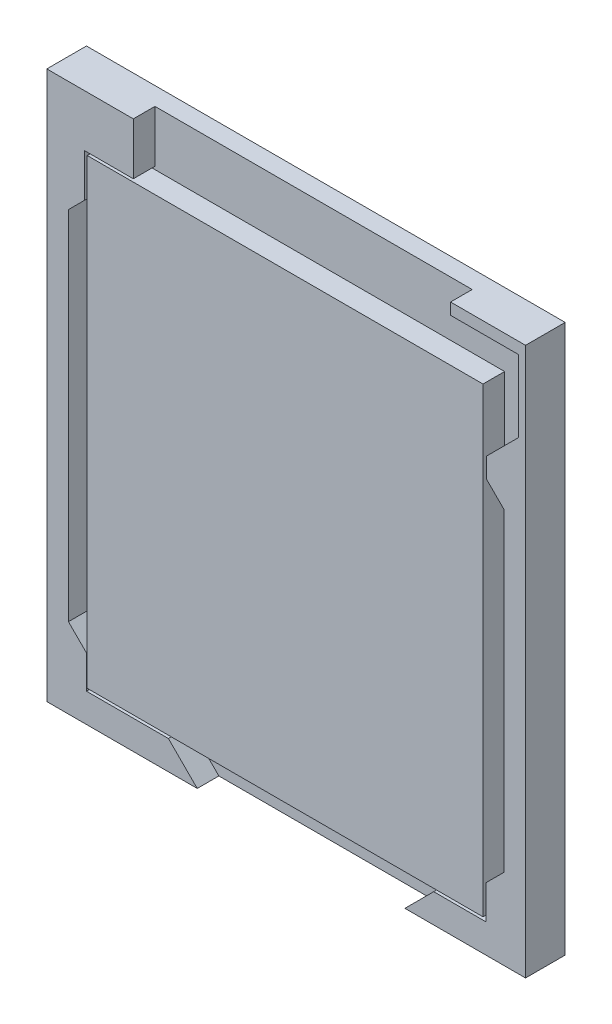
ISO-10303-21;
HEADER;
FILE_DESCRIPTION(('STEP AP214'),'2;1');
FILE_NAME('part.step','',(''),(''),'','','');
FILE_SCHEMA(('AUTOMOTIVE_DESIGN { 1 0 10303 214 1 1 1 1 }'));
ENDSEC;
DATA;
#1=APPLICATION_CONTEXT('core data for automotive mechanical design processes');
#2=APPLICATION_PROTOCOL_DEFINITION('international standard','automotive_design',2000,#1);
#3=PRODUCT_CONTEXT('',#1,'mechanical');
#4=PRODUCT('Part','Part','',(#3));
#5=PRODUCT_RELATED_PRODUCT_CATEGORY('part','',(#4));
#6=PRODUCT_DEFINITION_FORMATION('','',#4);
#7=PRODUCT_DEFINITION_CONTEXT('part definition',#1,'design');
#8=PRODUCT_DEFINITION('design','',#6,#7);
#9=PRODUCT_DEFINITION_SHAPE('','',#8);
#10=(LENGTH_UNIT() NAMED_UNIT(*) SI_UNIT(.MILLI.,.METRE.));
#11=(NAMED_UNIT(*) PLANE_ANGLE_UNIT() SI_UNIT($,.RADIAN.));
#12=(NAMED_UNIT(*) SI_UNIT($,.STERADIAN.) SOLID_ANGLE_UNIT());
#13=UNCERTAINTY_MEASURE_WITH_UNIT(LENGTH_MEASURE(1.E-05),#10,'distance_accuracy_value','');
#14=(GEOMETRIC_REPRESENTATION_CONTEXT(3) GLOBAL_UNCERTAINTY_ASSIGNED_CONTEXT((#13)) GLOBAL_UNIT_ASSIGNED_CONTEXT((#10,
#11,#12)) REPRESENTATION_CONTEXT('',''));
#15=CARTESIAN_POINT('',(0.,0.,0.));
#16=DIRECTION('',(0.,0.,1.));
#17=DIRECTION('',(1.,0.,0.));
#18=AXIS2_PLACEMENT_3D('',#15,#16,#17);
#19=CARTESIAN_POINT('',(0.,0.,1.25));
#20=DIRECTION('',(0.,0.,1.));
#21=DIRECTION('',(1.,0.,0.));
#22=AXIS2_PLACEMENT_3D('',#19,#20,#21);
#23=PLANE('',#22);
#24=DIRECTION('',(0.707106781186546,-0.707106781186549,0.));
#25=VECTOR('',#24,1.);
#26=CARTESIAN_POINT('',(-8.16774694977854,-17.,1.25));
#27=LINE('',#26,#25);
#28=CARTESIAN_POINT('',(-8.16774694977854,-17.,1.25));
#29=VERTEX_POINT('',#28);
#30=CARTESIAN_POINT('',(-6.16774694977855,-19.,1.25));
#31=VERTEX_POINT('',#30);
#32=EDGE_CURVE('E263',#29,#31,#27,.T.);
#33=ORIENTED_EDGE('',*,*,#32,.T.);
#34=DIRECTION('',(1.,0.,0.));
#35=VECTOR('',#34,1.);
#36=CARTESIAN_POINT('',(-6.16774694977855,-19.,1.25));
#37=LINE('',#36,#35);
#38=CARTESIAN_POINT('',(8.23225305022145,-19.,1.25));
#39=VERTEX_POINT('',#38);
#40=EDGE_CURVE('E266',#31,#39,#37,.T.);
#41=ORIENTED_EDGE('',*,*,#40,.T.);
#42=DIRECTION('',(0.70710678118655,0.707106781186545,0.));
#43=VECTOR('',#42,1.);
#44=CARTESIAN_POINT('',(8.23225305022145,-19.,1.25));
#45=LINE('',#44,#43);
#46=CARTESIAN_POINT('',(10.2322530502215,-17.,1.25));
#47=VERTEX_POINT('',#46);
#48=EDGE_CURVE('E270',#39,#47,#45,.T.);
#49=ORIENTED_EDGE('',*,*,#48,.T.);
#50=DIRECTION('',(1.,0.,0.));
#51=VECTOR('',#50,1.);
#52=CARTESIAN_POINT('',(10.2322530502215,-17.,1.25));
#53=LINE('',#52,#51);
#54=CARTESIAN_POINT('',(13.85,-17.,1.25));
#55=VERTEX_POINT('',#54);
#56=EDGE_CURVE('E273',#47,#55,#53,.T.);
#57=ORIENTED_EDGE('',*,*,#56,.T.);
#58=DIRECTION('',(0.,1.,0.));
#59=VECTOR('',#58,1.);
#60=CARTESIAN_POINT('',(13.85,-17.,1.25));
#61=LINE('',#60,#59);
#62=CARTESIAN_POINT('',(13.85,-14.6554244337926,1.25));
#63=VERTEX_POINT('',#62);
#64=EDGE_CURVE('E276',#55,#63,#61,.T.);
#65=ORIENTED_EDGE('',*,*,#64,.T.);
#66=DIRECTION('',(0.707106781186549,0.707106781186546,0.));
#67=VECTOR('',#66,1.);
#68=CARTESIAN_POINT('',(13.85,-14.6554244337926,1.25));
#69=LINE('',#68,#67);
#70=CARTESIAN_POINT('',(15.1,-13.4054244337926,1.25));
#71=VERTEX_POINT('',#70);
#72=EDGE_CURVE('E279',#63,#71,#69,.T.);
#73=ORIENTED_EDGE('',*,*,#72,.T.);
#74=DIRECTION('',(0.,1.,0.));
#75=VECTOR('',#74,1.);
#76=CARTESIAN_POINT('',(15.1,-13.4054244337926,1.25));
#77=LINE('',#76,#75);
#78=CARTESIAN_POINT('',(15.1,8.4,1.25));
#79=VERTEX_POINT('',#78);
#80=EDGE_CURVE('E282',#71,#79,#77,.T.);
#81=ORIENTED_EDGE('',*,*,#80,.T.);
#82=DIRECTION('',(-0.707106781186547,0.707106781186548,0.));
#83=VECTOR('',#82,1.);
#84=CARTESIAN_POINT('',(15.1,8.4,1.25));
#85=LINE('',#84,#83);
#86=CARTESIAN_POINT('',(13.9,9.6,1.25));
#87=VERTEX_POINT('',#86);
#88=EDGE_CURVE('E285',#79,#87,#85,.T.);
#89=ORIENTED_EDGE('',*,*,#88,.T.);
#90=DIRECTION('',(0.,1.,0.));
#91=VECTOR('',#90,1.);
#92=CARTESIAN_POINT('',(13.9,9.6,1.25));
#93=LINE('',#92,#91);
#94=CARTESIAN_POINT('',(13.9,11.,1.25));
#95=VERTEX_POINT('',#94);
#96=EDGE_CURVE('E288',#87,#95,#93,.T.);
#97=ORIENTED_EDGE('',*,*,#96,.T.);
#98=DIRECTION('',(0.707106781186547,0.707106781186548,0.));
#99=VECTOR('',#98,1.);
#100=CARTESIAN_POINT('',(13.9,11.,1.25));
#101=LINE('',#100,#99);
#102=CARTESIAN_POINT('',(16.1,13.2,1.25));
#103=VERTEX_POINT('',#102);
#104=EDGE_CURVE('E291',#95,#103,#101,.T.);
#105=ORIENTED_EDGE('',*,*,#104,.T.);
#106=DIRECTION('',(0.,1.,0.));
#107=VECTOR('',#106,1.);
#108=CARTESIAN_POINT('',(16.1,13.2,1.25));
#109=LINE('',#108,#107);
#110=CARTESIAN_POINT('',(16.1,18.2,1.25));
#111=VERTEX_POINT('',#110);
#112=EDGE_CURVE('E294',#103,#111,#109,.T.);
#113=ORIENTED_EDGE('',*,*,#112,.T.);
#114=DIRECTION('',(-1.,0.,0.));
#115=VECTOR('',#114,1.);
#116=CARTESIAN_POINT('',(16.1,18.2,1.25));
#117=LINE('',#116,#115);
#118=CARTESIAN_POINT('',(11.4,18.2,1.25));
#119=VERTEX_POINT('',#118);
#120=EDGE_CURVE('E297',#111,#119,#117,.T.);
#121=ORIENTED_EDGE('',*,*,#120,.T.);
#122=DIRECTION('',(0.,1.,0.));
#123=VECTOR('',#122,1.);
#124=CARTESIAN_POINT('',(11.4,18.2,1.25));
#125=LINE('',#124,#123);
#126=CARTESIAN_POINT('',(11.4,19.,1.25));
#127=VERTEX_POINT('',#126);
#128=EDGE_CURVE('E300',#119,#127,#125,.T.);
#129=ORIENTED_EDGE('',*,*,#128,.T.);
#130=DIRECTION('',(-1.,0.,0.));
#131=VECTOR('',#130,1.);
#132=CARTESIAN_POINT('',(11.4,19.,1.25));
#133=LINE('',#132,#131);
#134=CARTESIAN_POINT('',(-10.6,19.,1.25));
#135=VERTEX_POINT('',#134);
#136=EDGE_CURVE('E303',#127,#135,#133,.T.);
#137=ORIENTED_EDGE('',*,*,#136,.T.);
#138=DIRECTION('',(0.,-1.,0.));
#139=VECTOR('',#138,1.);
#140=CARTESIAN_POINT('',(-10.6,19.,1.25));
#141=LINE('',#140,#139);
#142=CARTESIAN_POINT('',(-10.6,15.4,1.25));
#143=VERTEX_POINT('',#142);
#144=EDGE_CURVE('E306',#135,#143,#141,.T.);
#145=ORIENTED_EDGE('',*,*,#144,.T.);
#146=DIRECTION('',(-1.,0.,0.));
#147=VECTOR('',#146,1.);
#148=CARTESIAN_POINT('',(-10.6,15.4,1.25));
#149=LINE('',#148,#147);
#150=CARTESIAN_POINT('',(-14.,15.4,1.25));
#151=VERTEX_POINT('',#150);
#152=EDGE_CURVE('E309',#143,#151,#149,.T.);
#153=ORIENTED_EDGE('',*,*,#152,.T.);
#154=DIRECTION('',(0.,-1.,0.));
#155=VECTOR('',#154,1.);
#156=CARTESIAN_POINT('',(-14.,15.4,1.25));
#157=LINE('',#156,#155);
#158=CARTESIAN_POINT('',(-14.,12.4,1.25));
#159=VERTEX_POINT('',#158);
#160=EDGE_CURVE('E312',#151,#159,#157,.T.);
#161=ORIENTED_EDGE('',*,*,#160,.T.);
#162=DIRECTION('',(-0.707106781186547,-0.707106781186548,0.));
#163=VECTOR('',#162,1.);
#164=CARTESIAN_POINT('',(-14.,12.4,1.25));
#165=LINE('',#164,#163);
#166=CARTESIAN_POINT('',(-15.1,11.3,1.25));
#167=VERTEX_POINT('',#166);
#168=EDGE_CURVE('E315',#159,#167,#165,.T.);
#169=ORIENTED_EDGE('',*,*,#168,.T.);
#170=DIRECTION('',(0.,-1.,0.));
#171=VECTOR('',#170,1.);
#172=CARTESIAN_POINT('',(-15.1,11.3,1.25));
#173=LINE('',#172,#171);
#174=CARTESIAN_POINT('',(-15.1,-13.45,1.25));
#175=VERTEX_POINT('',#174);
#176=EDGE_CURVE('E318',#167,#175,#173,.T.);
#177=ORIENTED_EDGE('',*,*,#176,.T.);
#178=DIRECTION('',(0.70710678118655,-0.707106781186545,0.));
#179=VECTOR('',#178,1.);
#180=CARTESIAN_POINT('',(-15.1,-13.45,1.25));
#181=LINE('',#180,#179);
#182=CARTESIAN_POINT('',(-13.85,-14.7,1.25));
#183=VERTEX_POINT('',#182);
#184=EDGE_CURVE('E321',#175,#183,#181,.T.);
#185=ORIENTED_EDGE('',*,*,#184,.T.);
#186=DIRECTION('',(0.,-1.,0.));
#187=VECTOR('',#186,1.);
#188=CARTESIAN_POINT('',(-13.85,-14.7,1.25));
#189=LINE('',#188,#187);
#190=CARTESIAN_POINT('',(-13.85,-17.,1.25));
#191=VERTEX_POINT('',#190);
#192=EDGE_CURVE('E324',#183,#191,#189,.T.);
#193=ORIENTED_EDGE('',*,*,#192,.T.);
#194=DIRECTION('',(1.,0.,0.));
#195=VECTOR('',#194,1.);
#196=CARTESIAN_POINT('',(-13.85,-17.,1.25));
#197=LINE('',#196,#195);
#198=EDGE_CURVE('E327',#191,#29,#197,.T.);
#199=ORIENTED_EDGE('',*,*,#198,.T.);
#200=EDGE_LOOP('',(#33,#41,#49,#57,#65,#73,#81,#89,#97,#105,#113,#121,#129,#137,#145,#153,#161,
#169,#177,#185,#193,#199));
#201=FACE_BOUND('',#200,.T.);
#202=DIRECTION('',(1.,0.,0.));
#203=VECTOR('',#202,1.);
#204=CARTESIAN_POINT('',(-13.8,-16.8,1.25));
#205=LINE('',#204,#203);
#206=CARTESIAN_POINT('',(-13.8,-16.8,1.25));
#207=VERTEX_POINT('',#206);
#208=CARTESIAN_POINT('',(13.65,-16.8,1.25));
#209=VERTEX_POINT('',#208);
#210=EDGE_CURVE('E669',#207,#209,#205,.T.);
#211=ORIENTED_EDGE('',*,*,#210,.F.);
#212=DIRECTION('',(0.,-1.,0.));
#213=VECTOR('',#212,1.);
#214=CARTESIAN_POINT('',(-13.8,15.2,1.25));
#215=LINE('',#214,#213);
#216=CARTESIAN_POINT('',(-13.8,15.2,1.25));
#217=VERTEX_POINT('',#216);
#218=EDGE_CURVE('E254',#217,#207,#215,.T.);
#219=ORIENTED_EDGE('',*,*,#218,.F.);
#220=DIRECTION('',(-1.,0.,0.));
#221=VECTOR('',#220,1.);
#222=CARTESIAN_POINT('',(-13.8,15.2,1.25));
#223=LINE('',#222,#221);
#224=CARTESIAN_POINT('',(13.65,15.2,1.25));
#225=VERTEX_POINT('',#224);
#226=EDGE_CURVE('E250',#225,#217,#223,.T.);
#227=ORIENTED_EDGE('',*,*,#226,.F.);
#228=DIRECTION('',(0.,1.,0.));
#229=VECTOR('',#228,1.);
#230=CARTESIAN_POINT('',(13.65,15.2,1.25));
#231=LINE('',#230,#229);
#232=EDGE_CURVE('E666',#209,#225,#231,.T.);
#233=ORIENTED_EDGE('',*,*,#232,.F.);
#234=EDGE_LOOP('',(#211,#219,#227,#233));
#235=FACE_BOUND('',#234,.T.);
#236=ADVANCED_FACE('F33',(#201,#235),#23,.T.);
#237=CARTESIAN_POINT('',(0.,0.,2.75));
#238=DIRECTION('',(0.,0.,-1.));
#239=DIRECTION('',(-1.,0.,0.));
#240=AXIS2_PLACEMENT_3D('',#237,#238,#239);
#241=PLANE('',#240);
#242=DIRECTION('',(1.,0.,0.));
#243=VECTOR('',#242,1.);
#244=CARTESIAN_POINT('',(-16.6,-19.,2.75));
#245=LINE('',#244,#243);
#246=CARTESIAN_POINT('',(-16.6,-19.,2.75));
#247=VERTEX_POINT('',#246);
#248=CARTESIAN_POINT('',(-6.16774694977855,-19.,2.75));
#249=VERTEX_POINT('',#248);
#250=EDGE_CURVE('E440',#247,#249,#245,.T.);
#251=ORIENTED_EDGE('',*,*,#250,.T.);
#252=DIRECTION('',(0.707106781186546,-0.707106781186549,0.));
#253=VECTOR('',#252,1.);
#254=CARTESIAN_POINT('',(-8.16774694977854,-17.,2.75));
#255=LINE('',#254,#253);
#256=CARTESIAN_POINT('',(-8.16774694977854,-17.,2.75));
#257=VERTEX_POINT('',#256);
#258=EDGE_CURVE('E256',#257,#249,#255,.T.);
#259=ORIENTED_EDGE('',*,*,#258,.F.);
#260=DIRECTION('',(1.,0.,0.));
#261=VECTOR('',#260,1.);
#262=CARTESIAN_POINT('',(-13.85,-17.,2.75));
#263=LINE('',#262,#261);
#264=CARTESIAN_POINT('',(-13.85,-17.,2.75));
#265=VERTEX_POINT('',#264);
#266=EDGE_CURVE('E267',#265,#257,#263,.T.);
#267=ORIENTED_EDGE('',*,*,#266,.F.);
#268=DIRECTION('',(0.,-1.,0.));
#269=VECTOR('',#268,1.);
#270=CARTESIAN_POINT('',(-13.85,-14.7,2.75));
#271=LINE('',#270,#269);
#272=CARTESIAN_POINT('',(-13.85,-14.7,2.75));
#273=VERTEX_POINT('',#272);
#274=EDGE_CURVE('E379',#273,#265,#271,.T.);
#275=ORIENTED_EDGE('',*,*,#274,.F.);
#276=DIRECTION('',(0.70710678118655,-0.707106781186545,0.));
#277=VECTOR('',#276,1.);
#278=CARTESIAN_POINT('',(-15.1,-13.45,2.75));
#279=LINE('',#278,#277);
#280=CARTESIAN_POINT('',(-15.1,-13.45,2.75));
#281=VERTEX_POINT('',#280);
#282=EDGE_CURVE('E376',#281,#273,#279,.T.);
#283=ORIENTED_EDGE('',*,*,#282,.F.);
#284=DIRECTION('',(0.,-1.,0.));
#285=VECTOR('',#284,1.);
#286=CARTESIAN_POINT('',(-15.1,11.3,2.75));
#287=LINE('',#286,#285);
#288=CARTESIAN_POINT('',(-15.1,11.3,2.75));
#289=VERTEX_POINT('',#288);
#290=EDGE_CURVE('E373',#289,#281,#287,.T.);
#291=ORIENTED_EDGE('',*,*,#290,.F.);
#292=DIRECTION('',(-0.707106781186547,-0.707106781186548,0.));
#293=VECTOR('',#292,1.);
#294=CARTESIAN_POINT('',(-14.,12.4,2.75));
#295=LINE('',#294,#293);
#296=CARTESIAN_POINT('',(-14.,12.4,2.75));
#297=VERTEX_POINT('',#296);
#298=EDGE_CURVE('E370',#297,#289,#295,.T.);
#299=ORIENTED_EDGE('',*,*,#298,.F.);
#300=DIRECTION('',(0.,-1.,0.));
#301=VECTOR('',#300,1.);
#302=CARTESIAN_POINT('',(-14.,15.4,2.75));
#303=LINE('',#302,#301);
#304=CARTESIAN_POINT('',(-14.,15.4,2.75));
#305=VERTEX_POINT('',#304);
#306=EDGE_CURVE('E367',#305,#297,#303,.T.);
#307=ORIENTED_EDGE('',*,*,#306,.F.);
#308=DIRECTION('',(-1.,0.,0.));
#309=VECTOR('',#308,1.);
#310=CARTESIAN_POINT('',(-10.6,15.4,2.75));
#311=LINE('',#310,#309);
#312=CARTESIAN_POINT('',(-10.6,15.4,2.75));
#313=VERTEX_POINT('',#312);
#314=EDGE_CURVE('E364',#313,#305,#311,.T.);
#315=ORIENTED_EDGE('',*,*,#314,.F.);
#316=DIRECTION('',(0.,-1.,0.));
#317=VECTOR('',#316,1.);
#318=CARTESIAN_POINT('',(-10.6,19.,2.75));
#319=LINE('',#318,#317);
#320=CARTESIAN_POINT('',(-10.6,19.,2.75));
#321=VERTEX_POINT('',#320);
#322=EDGE_CURVE('E361',#321,#313,#319,.T.);
#323=ORIENTED_EDGE('',*,*,#322,.F.);
#324=DIRECTION('',(-1.,0.,0.));
#325=VECTOR('',#324,1.);
#326=CARTESIAN_POINT('',(-16.6,19.,2.75));
#327=LINE('',#326,#325);
#328=CARTESIAN_POINT('',(-16.6,19.,2.75));
#329=VERTEX_POINT('',#328);
#330=EDGE_CURVE('E432',#321,#329,#327,.T.);
#331=ORIENTED_EDGE('',*,*,#330,.T.);
#332=DIRECTION('',(0.,-1.,0.));
#333=VECTOR('',#332,1.);
#334=CARTESIAN_POINT('',(-16.6,-19.,2.75));
#335=LINE('',#334,#333);
#336=EDGE_CURVE('E437',#329,#247,#335,.T.);
#337=ORIENTED_EDGE('',*,*,#336,.T.);
#338=EDGE_LOOP('',(#251,#259,#267,#275,#283,#291,#299,#307,#315,#323,#331,#337));
#339=FACE_BOUND('',#338,.T.);
#340=ADVANCED_FACE('F490',(#339),#241,.F.);
#341=CARTESIAN_POINT('',(16.6,-19.,2.75));
#342=DIRECTION('',(-1.,0.,0.));
#343=DIRECTION('',(0.,0.,1.));
#344=AXIS2_PLACEMENT_3D('',#341,#342,#343);
#345=PLANE('',#344);
#346=DIRECTION('',(0.,1.,0.));
#347=VECTOR('',#346,1.);
#348=CARTESIAN_POINT('',(16.6,-19.,0.));
#349=LINE('',#348,#347);
#350=CARTESIAN_POINT('',(16.6,-19.,0.));
#351=VERTEX_POINT('',#350);
#352=CARTESIAN_POINT('',(16.6,19.,0.));
#353=VERTEX_POINT('',#352);
#354=EDGE_CURVE('E386',#351,#353,#349,.T.);
#355=ORIENTED_EDGE('',*,*,#354,.T.);
#356=DIRECTION('',(0.,0.,-1.));
#357=VECTOR('',#356,1.);
#358=CARTESIAN_POINT('',(16.6,19.,2.75));
#359=LINE('',#358,#357);
#360=CARTESIAN_POINT('',(16.6,19.,2.75));
#361=VERTEX_POINT('',#360);
#362=EDGE_CURVE('E11',#361,#353,#359,.T.);
#363=ORIENTED_EDGE('',*,*,#362,.F.);
#364=DIRECTION('',(0.,1.,0.));
#365=VECTOR('',#364,1.);
#366=CARTESIAN_POINT('',(16.6,-19.,2.75));
#367=LINE('',#366,#365);
#368=CARTESIAN_POINT('',(16.6,-19.,2.75));
#369=VERTEX_POINT('',#368);
#370=EDGE_CURVE('E429',#369,#361,#367,.T.);
#371=ORIENTED_EDGE('',*,*,#370,.F.);
#372=DIRECTION('',(0.,0.,-1.));
#373=VECTOR('',#372,1.);
#374=CARTESIAN_POINT('',(16.6,-19.,2.75));
#375=LINE('',#374,#373);
#376=EDGE_CURVE('E443',#369,#351,#375,.T.);
#377=ORIENTED_EDGE('',*,*,#376,.T.);
#378=EDGE_LOOP('',(#355,#363,#371,#377));
#379=FACE_BOUND('',#378,.T.);
#380=ADVANCED_FACE('F35',(#379),#345,.F.);
#381=CARTESIAN_POINT('',(-16.6,19.,2.75));
#382=DIRECTION('',(0.,-1.,0.));
#383=DIRECTION('',(0.,0.,-1.));
#384=AXIS2_PLACEMENT_3D('',#381,#382,#383);
#385=PLANE('',#384);
#386=ORIENTED_EDGE('',*,*,#330,.F.);
#387=DIRECTION('',(0.,0.,1.));
#388=VECTOR('',#387,1.);
#389=CARTESIAN_POINT('',(-10.6,19.,1.25));
#390=LINE('',#389,#388);
#391=EDGE_CURVE('E401',#135,#321,#390,.T.);
#392=ORIENTED_EDGE('',*,*,#391,.F.);
#393=ORIENTED_EDGE('',*,*,#136,.F.);
#394=DIRECTION('',(0.,0.,1.));
#395=VECTOR('',#394,1.);
#396=CARTESIAN_POINT('',(11.4,19.,1.25));
#397=LINE('',#396,#395);
#398=CARTESIAN_POINT('',(11.4,19.,2.75));
#399=VERTEX_POINT('',#398);
#400=EDGE_CURVE('E403',#127,#399,#397,.T.);
#401=ORIENTED_EDGE('',*,*,#400,.T.);
#402=EDGE_CURVE('E434',#361,#399,#327,.T.);
#403=ORIENTED_EDGE('',*,*,#402,.F.);
#404=ORIENTED_EDGE('',*,*,#362,.T.);
#405=DIRECTION('',(-1.,0.,0.));
#406=VECTOR('',#405,1.);
#407=CARTESIAN_POINT('',(-16.6,19.,0.));
#408=LINE('',#407,#406);
#409=CARTESIAN_POINT('',(-16.6,19.,0.));
#410=VERTEX_POINT('',#409);
#411=EDGE_CURVE('E446',#353,#410,#408,.T.);
#412=ORIENTED_EDGE('',*,*,#411,.T.);
#413=DIRECTION('',(0.,0.,-1.));
#414=VECTOR('',#413,1.);
#415=CARTESIAN_POINT('',(-16.6,19.,2.75));
#416=LINE('',#415,#414);
#417=EDGE_CURVE('E41',#329,#410,#416,.T.);
#418=ORIENTED_EDGE('',*,*,#417,.F.);
#419=EDGE_LOOP('',(#386,#392,#393,#401,#403,#404,#412,#418));
#420=FACE_BOUND('',#419,.T.);
#421=ADVANCED_FACE('F495',(#420),#385,.F.);
#422=CARTESIAN_POINT('',(-16.6,-19.,2.75));
#423=DIRECTION('',(1.,0.,0.));
#424=DIRECTION('',(0.,0.,-1.));
#425=AXIS2_PLACEMENT_3D('',#422,#423,#424);
#426=PLANE('',#425);
#427=DIRECTION('',(0.,-1.,0.));
#428=VECTOR('',#427,1.);
#429=CARTESIAN_POINT('',(-16.6,-19.,0.));
#430=LINE('',#429,#428);
#431=CARTESIAN_POINT('',(-16.6,-19.,0.));
#432=VERTEX_POINT('',#431);
#433=EDGE_CURVE('E448',#410,#432,#430,.T.);
#434=ORIENTED_EDGE('',*,*,#433,.T.);
#435=DIRECTION('',(0.,0.,-1.));
#436=VECTOR('',#435,1.);
#437=CARTESIAN_POINT('',(-16.6,-19.,2.75));
#438=LINE('',#437,#436);
#439=EDGE_CURVE('E453',#247,#432,#438,.T.);
#440=ORIENTED_EDGE('',*,*,#439,.F.);
#441=ORIENTED_EDGE('',*,*,#336,.F.);
#442=ORIENTED_EDGE('',*,*,#417,.T.);
#443=EDGE_LOOP('',(#434,#440,#441,#442));
#444=FACE_BOUND('',#443,.T.);
#445=ADVANCED_FACE('F460',(#444),#426,.F.);
#446=CARTESIAN_POINT('',(-16.6,-19.,2.75));
#447=DIRECTION('',(0.,1.,0.));
#448=DIRECTION('',(0.,0.,1.));
#449=AXIS2_PLACEMENT_3D('',#446,#447,#448);
#450=PLANE('',#449);
#451=ORIENTED_EDGE('',*,*,#40,.F.);
#452=DIRECTION('',(0.,0.,1.));
#453=VECTOR('',#452,1.);
#454=CARTESIAN_POINT('',(-6.16774694977855,-19.,1.25));
#455=LINE('',#454,#453);
#456=EDGE_CURVE('E329',#31,#249,#455,.T.);
#457=ORIENTED_EDGE('',*,*,#456,.T.);
#458=ORIENTED_EDGE('',*,*,#250,.F.);
#459=ORIENTED_EDGE('',*,*,#439,.T.);
#460=DIRECTION('',(1.,0.,0.));
#461=VECTOR('',#460,1.);
#462=CARTESIAN_POINT('',(-16.6,-19.,0.));
#463=LINE('',#462,#461);
#464=EDGE_CURVE('E433',#432,#351,#463,.T.);
#465=ORIENTED_EDGE('',*,*,#464,.T.);
#466=ORIENTED_EDGE('',*,*,#376,.F.);
#467=CARTESIAN_POINT('',(8.23225305022144,-19.,2.75));
#468=VERTEX_POINT('',#467);
#469=EDGE_CURVE('E439',#468,#369,#245,.T.);
#470=ORIENTED_EDGE('',*,*,#469,.F.);
#471=DIRECTION('',(0.,0.,1.));
#472=VECTOR('',#471,1.);
#473=CARTESIAN_POINT('',(8.23225305022145,-19.,1.25));
#474=LINE('',#473,#472);
#475=EDGE_CURVE('E56',#39,#468,#474,.T.);
#476=ORIENTED_EDGE('',*,*,#475,.F.);
#477=EDGE_LOOP('',(#451,#457,#458,#459,#465,#466,#470,#476));
#478=FACE_BOUND('',#477,.T.);
#479=ADVANCED_FACE('F471',(#478),#450,.F.);
#480=ORIENTED_EDGE('',*,*,#402,.T.);
#481=DIRECTION('',(0.,1.,0.));
#482=VECTOR('',#481,1.);
#483=CARTESIAN_POINT('',(11.4,18.2,2.75));
#484=LINE('',#483,#482);
#485=CARTESIAN_POINT('',(11.4,18.2,2.75));
#486=VERTEX_POINT('',#485);
#487=EDGE_CURVE('E359',#486,#399,#484,.T.);
#488=ORIENTED_EDGE('',*,*,#487,.F.);
#489=DIRECTION('',(-1.,0.,0.));
#490=VECTOR('',#489,1.);
#491=CARTESIAN_POINT('',(16.1,18.2,2.75));
#492=LINE('',#491,#490);
#493=CARTESIAN_POINT('',(16.1,18.2,2.75));
#494=VERTEX_POINT('',#493);
#495=EDGE_CURVE('E356',#494,#486,#492,.T.);
#496=ORIENTED_EDGE('',*,*,#495,.F.);
#497=DIRECTION('',(0.,1.,0.));
#498=VECTOR('',#497,1.);
#499=CARTESIAN_POINT('',(16.1,13.2,2.75));
#500=LINE('',#499,#498);
#501=CARTESIAN_POINT('',(16.1,13.2,2.75));
#502=VERTEX_POINT('',#501);
#503=EDGE_CURVE('E353',#502,#494,#500,.T.);
#504=ORIENTED_EDGE('',*,*,#503,.F.);
#505=DIRECTION('',(0.707106781186547,0.707106781186548,0.));
#506=VECTOR('',#505,1.);
#507=CARTESIAN_POINT('',(13.9,11.,2.75));
#508=LINE('',#507,#506);
#509=CARTESIAN_POINT('',(13.9,11.,2.75));
#510=VERTEX_POINT('',#509);
#511=EDGE_CURVE('E350',#510,#502,#508,.T.);
#512=ORIENTED_EDGE('',*,*,#511,.F.);
#513=DIRECTION('',(0.,1.,0.));
#514=VECTOR('',#513,1.);
#515=CARTESIAN_POINT('',(13.9,9.6,2.75));
#516=LINE('',#515,#514);
#517=CARTESIAN_POINT('',(13.9,9.6,2.75));
#518=VERTEX_POINT('',#517);
#519=EDGE_CURVE('E347',#518,#510,#516,.T.);
#520=ORIENTED_EDGE('',*,*,#519,.F.);
#521=DIRECTION('',(-0.707106781186547,0.707106781186548,0.));
#522=VECTOR('',#521,1.);
#523=CARTESIAN_POINT('',(15.1,8.4,2.75));
#524=LINE('',#523,#522);
#525=CARTESIAN_POINT('',(15.1,8.4,2.75));
#526=VERTEX_POINT('',#525);
#527=EDGE_CURVE('E344',#526,#518,#524,.T.);
#528=ORIENTED_EDGE('',*,*,#527,.F.);
#529=DIRECTION('',(0.,1.,0.));
#530=VECTOR('',#529,1.);
#531=CARTESIAN_POINT('',(15.1,-13.4054244337926,2.75));
#532=LINE('',#531,#530);
#533=CARTESIAN_POINT('',(15.1,-13.4054244337926,2.75));
#534=VERTEX_POINT('',#533);
#535=EDGE_CURVE('E341',#534,#526,#532,.T.);
#536=ORIENTED_EDGE('',*,*,#535,.F.);
#537=DIRECTION('',(0.707106781186549,0.707106781186546,0.));
#538=VECTOR('',#537,1.);
#539=CARTESIAN_POINT('',(13.85,-14.6554244337926,2.75));
#540=LINE('',#539,#538);
#541=CARTESIAN_POINT('',(13.85,-14.6554244337926,2.75));
#542=VERTEX_POINT('',#541);
#543=EDGE_CURVE('E338',#542,#534,#540,.T.);
#544=ORIENTED_EDGE('',*,*,#543,.F.);
#545=DIRECTION('',(0.,1.,0.));
#546=VECTOR('',#545,1.);
#547=CARTESIAN_POINT('',(13.85,-17.,2.75));
#548=LINE('',#547,#546);
#549=CARTESIAN_POINT('',(13.85,-17.,2.75));
#550=VERTEX_POINT('',#549);
#551=EDGE_CURVE('E335',#550,#542,#548,.T.);
#552=ORIENTED_EDGE('',*,*,#551,.F.);
#553=DIRECTION('',(1.,0.,0.));
#554=VECTOR('',#553,1.);
#555=CARTESIAN_POINT('',(10.2322530502215,-17.,2.75));
#556=LINE('',#555,#554);
#557=CARTESIAN_POINT('',(10.2322530502215,-17.,2.75));
#558=VERTEX_POINT('',#557);
#559=EDGE_CURVE('E332',#558,#550,#556,.T.);
#560=ORIENTED_EDGE('',*,*,#559,.F.);
#561=DIRECTION('',(0.70710678118655,0.707106781186545,0.));
#562=VECTOR('',#561,1.);
#563=CARTESIAN_POINT('',(8.23225305022145,-19.,2.75));
#564=LINE('',#563,#562);
#565=EDGE_CURVE('E258',#468,#558,#564,.T.);
#566=ORIENTED_EDGE('',*,*,#565,.F.);
#567=ORIENTED_EDGE('',*,*,#469,.T.);
#568=ORIENTED_EDGE('',*,*,#370,.T.);
#569=EDGE_LOOP('',(#480,#488,#496,#504,#512,#520,#528,#536,#544,#552,#560,#566,#567,#568));
#570=FACE_BOUND('',#569,.T.);
#571=ADVANCED_FACE('F478',(#570),#241,.F.);
#572=CARTESIAN_POINT('',(0.,0.,0.));
#573=DIRECTION('',(0.,0.,-1.));
#574=DIRECTION('',(-1.,0.,0.));
#575=AXIS2_PLACEMENT_3D('',#572,#573,#574);
#576=PLANE('',#575);
#577=ORIENTED_EDGE('',*,*,#354,.F.);
#578=ORIENTED_EDGE('',*,*,#464,.F.);
#579=ORIENTED_EDGE('',*,*,#433,.F.);
#580=ORIENTED_EDGE('',*,*,#411,.F.);
#581=EDGE_LOOP('',(#577,#578,#579,#580));
#582=FACE_BOUND('',#581,.T.);
#583=ADVANCED_FACE('F467',(#582),#576,.T.);
#584=CARTESIAN_POINT('',(-8.16774694977854,-17.,1.25));
#585=DIRECTION('',(-0.707106781186549,-0.707106781186546,0.));
#586=DIRECTION('',(0.707106781186546,-0.707106781186549,0.));
#587=AXIS2_PLACEMENT_3D('',#584,#585,#586);
#588=PLANE('',#587);
#589=ORIENTED_EDGE('',*,*,#258,.T.);
#590=ORIENTED_EDGE('',*,*,#456,.F.);
#591=ORIENTED_EDGE('',*,*,#32,.F.);
#592=DIRECTION('',(0.,0.,1.));
#593=VECTOR('',#592,1.);
#594=CARTESIAN_POINT('',(-8.16774694977854,-17.,1.25));
#595=LINE('',#594,#593);
#596=EDGE_CURVE('E384',#29,#257,#595,.T.);
#597=ORIENTED_EDGE('',*,*,#596,.T.);
#598=EDGE_LOOP('',(#589,#590,#591,#597));
#599=FACE_BOUND('',#598,.T.);
#600=ADVANCED_FACE('F486',(#599),#588,.F.);
#601=CARTESIAN_POINT('',(-13.85,-17.,1.25));
#602=DIRECTION('',(0.,-1.,0.));
#603=DIRECTION('',(0.,0.,-1.));
#604=AXIS2_PLACEMENT_3D('',#601,#602,#603);
#605=PLANE('',#604);
#606=ORIENTED_EDGE('',*,*,#266,.T.);
#607=ORIENTED_EDGE('',*,*,#596,.F.);
#608=ORIENTED_EDGE('',*,*,#198,.F.);
#609=DIRECTION('',(0.,0.,1.));
#610=VECTOR('',#609,1.);
#611=CARTESIAN_POINT('',(-13.85,-17.,1.25));
#612=LINE('',#611,#610);
#613=EDGE_CURVE('E387',#191,#265,#612,.T.);
#614=ORIENTED_EDGE('',*,*,#613,.T.);
#615=EDGE_LOOP('',(#606,#607,#608,#614));
#616=FACE_BOUND('',#615,.T.);
#617=ADVANCED_FACE('F556',(#616),#605,.F.);
#618=CARTESIAN_POINT('',(-13.85,-14.7,1.25));
#619=DIRECTION('',(-1.,0.,0.));
#620=DIRECTION('',(0.,0.,1.));
#621=AXIS2_PLACEMENT_3D('',#618,#619,#620);
#622=PLANE('',#621);
#623=ORIENTED_EDGE('',*,*,#274,.T.);
#624=ORIENTED_EDGE('',*,*,#613,.F.);
#625=ORIENTED_EDGE('',*,*,#192,.F.);
#626=DIRECTION('',(0.,0.,1.));
#627=VECTOR('',#626,1.);
#628=CARTESIAN_POINT('',(-13.85,-14.7,1.25));
#629=LINE('',#628,#627);
#630=EDGE_CURVE('E389',#183,#273,#629,.T.);
#631=ORIENTED_EDGE('',*,*,#630,.T.);
#632=EDGE_LOOP('',(#623,#624,#625,#631));
#633=FACE_BOUND('',#632,.T.);
#634=ADVANCED_FACE('F559',(#633),#622,.F.);
#635=CARTESIAN_POINT('',(-15.1,-13.45,1.25));
#636=DIRECTION('',(-0.707106781186545,-0.70710678118655,0.));
#637=DIRECTION('',(0.70710678118655,-0.707106781186545,0.));
#638=AXIS2_PLACEMENT_3D('',#635,#636,#637);
#639=PLANE('',#638);
#640=ORIENTED_EDGE('',*,*,#282,.T.);
#641=ORIENTED_EDGE('',*,*,#630,.F.);
#642=ORIENTED_EDGE('',*,*,#184,.F.);
#643=DIRECTION('',(0.,0.,1.));
#644=VECTOR('',#643,1.);
#645=CARTESIAN_POINT('',(-15.1,-13.45,1.25));
#646=LINE('',#645,#644);
#647=EDGE_CURVE('E391',#175,#281,#646,.T.);
#648=ORIENTED_EDGE('',*,*,#647,.T.);
#649=EDGE_LOOP('',(#640,#641,#642,#648));
#650=FACE_BOUND('',#649,.T.);
#651=ADVANCED_FACE('F563',(#650),#639,.F.);
#652=CARTESIAN_POINT('',(-15.1,11.3,1.25));
#653=DIRECTION('',(-1.,0.,0.));
#654=DIRECTION('',(0.,-1.,0.));
#655=AXIS2_PLACEMENT_3D('',#652,#653,#654);
#656=PLANE('',#655);
#657=ORIENTED_EDGE('',*,*,#290,.T.);
#658=ORIENTED_EDGE('',*,*,#647,.F.);
#659=ORIENTED_EDGE('',*,*,#176,.F.);
#660=DIRECTION('',(0.,0.,1.));
#661=VECTOR('',#660,1.);
#662=CARTESIAN_POINT('',(-15.1,11.3,1.25));
#663=LINE('',#662,#661);
#664=EDGE_CURVE('E393',#167,#289,#663,.T.);
#665=ORIENTED_EDGE('',*,*,#664,.T.);
#666=EDGE_LOOP('',(#657,#658,#659,#665));
#667=FACE_BOUND('',#666,.T.);
#668=ADVANCED_FACE('F567',(#667),#656,.F.);
#669=CARTESIAN_POINT('',(-14.,12.4,1.25));
#670=DIRECTION('',(-0.707106781186548,0.707106781186547,0.));
#671=DIRECTION('',(-0.707106781186547,-0.707106781186548,0.));
#672=AXIS2_PLACEMENT_3D('',#669,#670,#671);
#673=PLANE('',#672);
#674=ORIENTED_EDGE('',*,*,#298,.T.);
#675=ORIENTED_EDGE('',*,*,#664,.F.);
#676=ORIENTED_EDGE('',*,*,#168,.F.);
#677=DIRECTION('',(0.,0.,1.));
#678=VECTOR('',#677,1.);
#679=CARTESIAN_POINT('',(-14.,12.4,1.25));
#680=LINE('',#679,#678);
#681=EDGE_CURVE('E395',#159,#297,#680,.T.);
#682=ORIENTED_EDGE('',*,*,#681,.T.);
#683=EDGE_LOOP('',(#674,#675,#676,#682));
#684=FACE_BOUND('',#683,.T.);
#685=ADVANCED_FACE('F571',(#684),#673,.F.);
#686=CARTESIAN_POINT('',(-14.,15.4,1.25));
#687=DIRECTION('',(-1.,0.,0.));
#688=DIRECTION('',(0.,-1.,0.));
#689=AXIS2_PLACEMENT_3D('',#686,#687,#688);
#690=PLANE('',#689);
#691=ORIENTED_EDGE('',*,*,#306,.T.);
#692=ORIENTED_EDGE('',*,*,#681,.F.);
#693=ORIENTED_EDGE('',*,*,#160,.F.);
#694=DIRECTION('',(0.,0.,1.));
#695=VECTOR('',#694,1.);
#696=CARTESIAN_POINT('',(-14.,15.4,1.25));
#697=LINE('',#696,#695);
#698=EDGE_CURVE('E397',#151,#305,#697,.T.);
#699=ORIENTED_EDGE('',*,*,#698,.T.);
#700=EDGE_LOOP('',(#691,#692,#693,#699));
#701=FACE_BOUND('',#700,.T.);
#702=ADVANCED_FACE('F575',(#701),#690,.F.);
#703=CARTESIAN_POINT('',(-10.6,15.4,1.25));
#704=DIRECTION('',(0.,1.,0.));
#705=DIRECTION('',(0.,0.,1.));
#706=AXIS2_PLACEMENT_3D('',#703,#704,#705);
#707=PLANE('',#706);
#708=ORIENTED_EDGE('',*,*,#314,.T.);
#709=ORIENTED_EDGE('',*,*,#698,.F.);
#710=ORIENTED_EDGE('',*,*,#152,.F.);
#711=DIRECTION('',(0.,0.,1.));
#712=VECTOR('',#711,1.);
#713=CARTESIAN_POINT('',(-10.6,15.4,1.25));
#714=LINE('',#713,#712);
#715=EDGE_CURVE('E399',#143,#313,#714,.T.);
#716=ORIENTED_EDGE('',*,*,#715,.T.);
#717=EDGE_LOOP('',(#708,#709,#710,#716));
#718=FACE_BOUND('',#717,.T.);
#719=ADVANCED_FACE('F579',(#718),#707,.F.);
#720=CARTESIAN_POINT('',(-10.6,19.,1.25));
#721=DIRECTION('',(-1.,0.,0.));
#722=DIRECTION('',(0.,-1.,0.));
#723=AXIS2_PLACEMENT_3D('',#720,#721,#722);
#724=PLANE('',#723);
#725=ORIENTED_EDGE('',*,*,#322,.T.);
#726=ORIENTED_EDGE('',*,*,#715,.F.);
#727=ORIENTED_EDGE('',*,*,#144,.F.);
#728=ORIENTED_EDGE('',*,*,#391,.T.);
#729=EDGE_LOOP('',(#725,#726,#727,#728));
#730=FACE_BOUND('',#729,.T.);
#731=ADVANCED_FACE('F498',(#730),#724,.F.);
#732=CARTESIAN_POINT('',(11.4,18.2,1.25));
#733=DIRECTION('',(1.,0.,0.));
#734=DIRECTION('',(0.,0.,-1.));
#735=AXIS2_PLACEMENT_3D('',#732,#733,#734);
#736=PLANE('',#735);
#737=ORIENTED_EDGE('',*,*,#487,.T.);
#738=ORIENTED_EDGE('',*,*,#400,.F.);
#739=ORIENTED_EDGE('',*,*,#128,.F.);
#740=DIRECTION('',(0.,0.,1.));
#741=VECTOR('',#740,1.);
#742=CARTESIAN_POINT('',(11.4,18.2,1.25));
#743=LINE('',#742,#741);
#744=EDGE_CURVE('E406',#119,#486,#743,.T.);
#745=ORIENTED_EDGE('',*,*,#744,.T.);
#746=EDGE_LOOP('',(#737,#738,#739,#745));
#747=FACE_BOUND('',#746,.T.);
#748=ADVANCED_FACE('F503',(#747),#736,.F.);
#749=CARTESIAN_POINT('',(16.1,18.2,1.25));
#750=DIRECTION('',(0.,1.,0.));
#751=DIRECTION('',(0.,0.,1.));
#752=AXIS2_PLACEMENT_3D('',#749,#750,#751);
#753=PLANE('',#752);
#754=ORIENTED_EDGE('',*,*,#495,.T.);
#755=ORIENTED_EDGE('',*,*,#744,.F.);
#756=ORIENTED_EDGE('',*,*,#120,.F.);
#757=DIRECTION('',(0.,0.,1.));
#758=VECTOR('',#757,1.);
#759=CARTESIAN_POINT('',(16.1,18.2,1.25));
#760=LINE('',#759,#758);
#761=EDGE_CURVE('E408',#111,#494,#760,.T.);
#762=ORIENTED_EDGE('',*,*,#761,.T.);
#763=EDGE_LOOP('',(#754,#755,#756,#762));
#764=FACE_BOUND('',#763,.T.);
#765=ADVANCED_FACE('F508',(#764),#753,.F.);
#766=CARTESIAN_POINT('',(16.1,13.2,1.25));
#767=DIRECTION('',(1.,0.,0.));
#768=DIRECTION('',(0.,0.,-1.));
#769=AXIS2_PLACEMENT_3D('',#766,#767,#768);
#770=PLANE('',#769);
#771=ORIENTED_EDGE('',*,*,#503,.T.);
#772=ORIENTED_EDGE('',*,*,#761,.F.);
#773=ORIENTED_EDGE('',*,*,#112,.F.);
#774=DIRECTION('',(0.,0.,1.));
#775=VECTOR('',#774,1.);
#776=CARTESIAN_POINT('',(16.1,13.2,1.25));
#777=LINE('',#776,#775);
#778=EDGE_CURVE('E410',#103,#502,#777,.T.);
#779=ORIENTED_EDGE('',*,*,#778,.T.);
#780=EDGE_LOOP('',(#771,#772,#773,#779));
#781=FACE_BOUND('',#780,.T.);
#782=ADVANCED_FACE('F511',(#781),#770,.F.);
#783=CARTESIAN_POINT('',(13.9,11.,1.25));
#784=DIRECTION('',(0.707106781186548,-0.707106781186547,0.));
#785=DIRECTION('',(0.707106781186547,0.707106781186548,0.));
#786=AXIS2_PLACEMENT_3D('',#783,#784,#785);
#787=PLANE('',#786);
#788=ORIENTED_EDGE('',*,*,#511,.T.);
#789=ORIENTED_EDGE('',*,*,#778,.F.);
#790=ORIENTED_EDGE('',*,*,#104,.F.);
#791=DIRECTION('',(0.,0.,1.));
#792=VECTOR('',#791,1.);
#793=CARTESIAN_POINT('',(13.9,11.,1.25));
#794=LINE('',#793,#792);
#795=EDGE_CURVE('E412',#95,#510,#794,.T.);
#796=ORIENTED_EDGE('',*,*,#795,.T.);
#797=EDGE_LOOP('',(#788,#789,#790,#796));
#798=FACE_BOUND('',#797,.T.);
#799=ADVANCED_FACE('F514',(#798),#787,.F.);
#800=CARTESIAN_POINT('',(13.9,9.6,1.25));
#801=DIRECTION('',(1.,0.,0.));
#802=DIRECTION('',(0.,0.,-1.));
#803=AXIS2_PLACEMENT_3D('',#800,#801,#802);
#804=PLANE('',#803);
#805=ORIENTED_EDGE('',*,*,#519,.T.);
#806=ORIENTED_EDGE('',*,*,#795,.F.);
#807=ORIENTED_EDGE('',*,*,#96,.F.);
#808=DIRECTION('',(0.,0.,1.));
#809=VECTOR('',#808,1.);
#810=CARTESIAN_POINT('',(13.9,9.6,1.25));
#811=LINE('',#810,#809);
#812=EDGE_CURVE('E414',#87,#518,#811,.T.);
#813=ORIENTED_EDGE('',*,*,#812,.T.);
#814=EDGE_LOOP('',(#805,#806,#807,#813));
#815=FACE_BOUND('',#814,.T.);
#816=ADVANCED_FACE('F519',(#815),#804,.F.);
#817=CARTESIAN_POINT('',(15.1,8.4,1.25));
#818=DIRECTION('',(0.707106781186548,0.707106781186547,0.));
#819=DIRECTION('',(-0.707106781186547,0.707106781186548,0.));
#820=AXIS2_PLACEMENT_3D('',#817,#818,#819);
#821=PLANE('',#820);
#822=ORIENTED_EDGE('',*,*,#527,.T.);
#823=ORIENTED_EDGE('',*,*,#812,.F.);
#824=ORIENTED_EDGE('',*,*,#88,.F.);
#825=DIRECTION('',(0.,0.,1.));
#826=VECTOR('',#825,1.);
#827=CARTESIAN_POINT('',(15.1,8.4,1.25));
#828=LINE('',#827,#826);
#829=EDGE_CURVE('E416',#79,#526,#828,.T.);
#830=ORIENTED_EDGE('',*,*,#829,.T.);
#831=EDGE_LOOP('',(#822,#823,#824,#830));
#832=FACE_BOUND('',#831,.T.);
#833=ADVANCED_FACE('F523',(#832),#821,.F.);
#834=CARTESIAN_POINT('',(15.1,-13.4054244337926,1.25));
#835=DIRECTION('',(1.,0.,0.));
#836=DIRECTION('',(0.,0.,-1.));
#837=AXIS2_PLACEMENT_3D('',#834,#835,#836);
#838=PLANE('',#837);
#839=ORIENTED_EDGE('',*,*,#535,.T.);
#840=ORIENTED_EDGE('',*,*,#829,.F.);
#841=ORIENTED_EDGE('',*,*,#80,.F.);
#842=DIRECTION('',(0.,0.,1.));
#843=VECTOR('',#842,1.);
#844=CARTESIAN_POINT('',(15.1,-13.4054244337926,1.25));
#845=LINE('',#844,#843);
#846=EDGE_CURVE('E418',#71,#534,#845,.T.);
#847=ORIENTED_EDGE('',*,*,#846,.T.);
#848=EDGE_LOOP('',(#839,#840,#841,#847));
#849=FACE_BOUND('',#848,.T.);
#850=ADVANCED_FACE('F526',(#849),#838,.F.);
#851=CARTESIAN_POINT('',(13.85,-14.6554244337926,1.25));
#852=DIRECTION('',(0.707106781186546,-0.707106781186549,0.));
#853=DIRECTION('',(0.707106781186549,0.707106781186546,0.));
#854=AXIS2_PLACEMENT_3D('',#851,#852,#853);
#855=PLANE('',#854);
#856=ORIENTED_EDGE('',*,*,#543,.T.);
#857=ORIENTED_EDGE('',*,*,#846,.F.);
#858=ORIENTED_EDGE('',*,*,#72,.F.);
#859=DIRECTION('',(0.,0.,1.));
#860=VECTOR('',#859,1.);
#861=CARTESIAN_POINT('',(13.85,-14.6554244337926,1.25));
#862=LINE('',#861,#860);
#863=EDGE_CURVE('E420',#63,#542,#862,.T.);
#864=ORIENTED_EDGE('',*,*,#863,.T.);
#865=EDGE_LOOP('',(#856,#857,#858,#864));
#866=FACE_BOUND('',#865,.T.);
#867=ADVANCED_FACE('F530',(#866),#855,.F.);
#868=CARTESIAN_POINT('',(13.85,-17.,1.25));
#869=DIRECTION('',(1.,0.,0.));
#870=DIRECTION('',(0.,0.,-1.));
#871=AXIS2_PLACEMENT_3D('',#868,#869,#870);
#872=PLANE('',#871);
#873=ORIENTED_EDGE('',*,*,#551,.T.);
#874=ORIENTED_EDGE('',*,*,#863,.F.);
#875=ORIENTED_EDGE('',*,*,#64,.F.);
#876=DIRECTION('',(0.,0.,1.));
#877=VECTOR('',#876,1.);
#878=CARTESIAN_POINT('',(13.85,-17.,1.25));
#879=LINE('',#878,#877);
#880=EDGE_CURVE('E422',#55,#550,#879,.T.);
#881=ORIENTED_EDGE('',*,*,#880,.T.);
#882=EDGE_LOOP('',(#873,#874,#875,#881));
#883=FACE_BOUND('',#882,.T.);
#884=ADVANCED_FACE('F534',(#883),#872,.F.);
#885=CARTESIAN_POINT('',(10.2322530502215,-17.,1.25));
#886=DIRECTION('',(0.,-1.,0.));
#887=DIRECTION('',(0.,0.,-1.));
#888=AXIS2_PLACEMENT_3D('',#885,#886,#887);
#889=PLANE('',#888);
#890=ORIENTED_EDGE('',*,*,#559,.T.);
#891=ORIENTED_EDGE('',*,*,#880,.F.);
#892=ORIENTED_EDGE('',*,*,#56,.F.);
#893=DIRECTION('',(0.,0.,1.));
#894=VECTOR('',#893,1.);
#895=CARTESIAN_POINT('',(10.2322530502215,-17.,1.25));
#896=LINE('',#895,#894);
#897=EDGE_CURVE('E424',#47,#558,#896,.T.);
#898=ORIENTED_EDGE('',*,*,#897,.T.);
#899=EDGE_LOOP('',(#890,#891,#892,#898));
#900=FACE_BOUND('',#899,.T.);
#901=ADVANCED_FACE('F537',(#900),#889,.F.);
#902=CARTESIAN_POINT('',(8.23225305022145,-19.,1.25));
#903=DIRECTION('',(0.707106781186545,-0.70710678118655,0.));
#904=DIRECTION('',(0.70710678118655,0.707106781186545,0.));
#905=AXIS2_PLACEMENT_3D('',#902,#903,#904);
#906=PLANE('',#905);
#907=ORIENTED_EDGE('',*,*,#565,.T.);
#908=ORIENTED_EDGE('',*,*,#897,.F.);
#909=ORIENTED_EDGE('',*,*,#48,.F.);
#910=ORIENTED_EDGE('',*,*,#475,.T.);
#911=EDGE_LOOP('',(#907,#908,#909,#910));
#912=FACE_BOUND('',#911,.T.);
#913=ADVANCED_FACE('F538',(#912),#906,.F.);
#914=CARTESIAN_POINT('',(-13.8,15.2,2.75));
#915=DIRECTION('',(1.,0.,0.));
#916=DIRECTION('',(0.,1.,0.));
#917=AXIS2_PLACEMENT_3D('',#914,#915,#916);
#918=PLANE('',#917);
#919=ORIENTED_EDGE('',*,*,#218,.T.);
#920=DIRECTION('',(0.,0.,-1.));
#921=VECTOR('',#920,1.);
#922=CARTESIAN_POINT('',(-13.8,-16.8,2.75));
#923=LINE('',#922,#921);
#924=CARTESIAN_POINT('',(-13.8,-16.8,2.75));
#925=VERTEX_POINT('',#924);
#926=EDGE_CURVE('E235',#925,#207,#923,.T.);
#927=ORIENTED_EDGE('',*,*,#926,.F.);
#928=DIRECTION('',(0.,-1.,0.));
#929=VECTOR('',#928,1.);
#930=CARTESIAN_POINT('',(-13.8,15.2,2.75));
#931=LINE('',#930,#929);
#932=CARTESIAN_POINT('',(-13.8,15.2,2.75));
#933=VERTEX_POINT('',#932);
#934=EDGE_CURVE('E242',#933,#925,#931,.T.);
#935=ORIENTED_EDGE('',*,*,#934,.F.);
#936=DIRECTION('',(0.,0.,-1.));
#937=VECTOR('',#936,1.);
#938=CARTESIAN_POINT('',(-13.8,15.2,2.75));
#939=LINE('',#938,#937);
#940=EDGE_CURVE('E664',#933,#217,#939,.T.);
#941=ORIENTED_EDGE('',*,*,#940,.T.);
#942=EDGE_LOOP('',(#919,#927,#935,#941));
#943=FACE_BOUND('',#942,.T.);
#944=ADVANCED_FACE('F252',(#943),#918,.F.);
#945=CARTESIAN_POINT('',(-13.8,-16.8,2.75));
#946=DIRECTION('',(0.,1.,0.));
#947=DIRECTION('',(0.,0.,1.));
#948=AXIS2_PLACEMENT_3D('',#945,#946,#947);
#949=PLANE('',#948);
#950=ORIENTED_EDGE('',*,*,#210,.T.);
#951=DIRECTION('',(0.,0.,-1.));
#952=VECTOR('',#951,1.);
#953=CARTESIAN_POINT('',(13.65,-16.8,2.75));
#954=LINE('',#953,#952);
#955=CARTESIAN_POINT('',(13.65,-16.8,2.75));
#956=VERTEX_POINT('',#955);
#957=EDGE_CURVE('E238',#956,#209,#954,.T.);
#958=ORIENTED_EDGE('',*,*,#957,.F.);
#959=DIRECTION('',(1.,0.,0.));
#960=VECTOR('',#959,1.);
#961=CARTESIAN_POINT('',(-13.8,-16.8,2.75));
#962=LINE('',#961,#960);
#963=EDGE_CURVE('E231',#925,#956,#962,.T.);
#964=ORIENTED_EDGE('',*,*,#963,.F.);
#965=ORIENTED_EDGE('',*,*,#926,.T.);
#966=EDGE_LOOP('',(#950,#958,#964,#965));
#967=FACE_BOUND('',#966,.T.);
#968=ADVANCED_FACE('F233',(#967),#949,.F.);
#969=CARTESIAN_POINT('',(13.65,15.2,2.75));
#970=DIRECTION('',(-1.,0.,0.));
#971=DIRECTION('',(0.,-1.,0.));
#972=AXIS2_PLACEMENT_3D('',#969,#970,#971);
#973=PLANE('',#972);
#974=ORIENTED_EDGE('',*,*,#232,.T.);
#975=DIRECTION('',(0.,0.,-1.));
#976=VECTOR('',#975,1.);
#977=CARTESIAN_POINT('',(13.65,15.2,2.75));
#978=LINE('',#977,#976);
#979=CARTESIAN_POINT('',(13.65,15.2,2.75));
#980=VERTEX_POINT('',#979);
#981=EDGE_CURVE('E48',#980,#225,#978,.T.);
#982=ORIENTED_EDGE('',*,*,#981,.F.);
#983=DIRECTION('',(0.,1.,0.));
#984=VECTOR('',#983,1.);
#985=CARTESIAN_POINT('',(13.65,15.2,2.75));
#986=LINE('',#985,#984);
#987=EDGE_CURVE('E241',#956,#980,#986,.T.);
#988=ORIENTED_EDGE('',*,*,#987,.F.);
#989=ORIENTED_EDGE('',*,*,#957,.T.);
#990=EDGE_LOOP('',(#974,#982,#988,#989));
#991=FACE_BOUND('',#990,.T.);
#992=ADVANCED_FACE('F634',(#991),#973,.F.);
#993=CARTESIAN_POINT('',(-13.8,15.2,2.75));
#994=DIRECTION('',(0.,-1.,0.));
#995=DIRECTION('',(0.,0.,-1.));
#996=AXIS2_PLACEMENT_3D('',#993,#994,#995);
#997=PLANE('',#996);
#998=ORIENTED_EDGE('',*,*,#226,.T.);
#999=ORIENTED_EDGE('',*,*,#940,.F.);
#1000=DIRECTION('',(-1.,0.,0.));
#1001=VECTOR('',#1000,1.);
#1002=CARTESIAN_POINT('',(-13.8,15.2,2.75));
#1003=LINE('',#1002,#1001);
#1004=EDGE_CURVE('E246',#980,#933,#1003,.T.);
#1005=ORIENTED_EDGE('',*,*,#1004,.F.);
#1006=ORIENTED_EDGE('',*,*,#981,.T.);
#1007=EDGE_LOOP('',(#998,#999,#1005,#1006));
#1008=FACE_BOUND('',#1007,.T.);
#1009=ADVANCED_FACE('F642',(#1008),#997,.F.);
#1010=CARTESIAN_POINT('',(0.,0.,2.75));
#1011=DIRECTION('',(0.,0.,1.));
#1012=DIRECTION('',(1.,0.,0.));
#1013=AXIS2_PLACEMENT_3D('',#1010,#1011,#1012);
#1014=PLANE('',#1013);
#1015=ORIENTED_EDGE('',*,*,#934,.T.);
#1016=ORIENTED_EDGE('',*,*,#963,.T.);
#1017=ORIENTED_EDGE('',*,*,#987,.T.);
#1018=ORIENTED_EDGE('',*,*,#1004,.T.);
#1019=EDGE_LOOP('',(#1015,#1016,#1017,#1018));
#1020=FACE_BOUND('',#1019,.T.);
#1021=ADVANCED_FACE('F245',(#1020),#1014,.T.);
#1022=CLOSED_SHELL('',(#236,#340,#380,#421,#445,#479,#571,#583,#600,#617,#634,#651,#668,#685,
#702,#719,#731,#748,#765,#782,#799,#816,#833,#850,#867,#884,#901,#913,#944,#968,#992,#1009,#1021));
#1023=MANIFOLD_SOLID_BREP('B2',#1022);
#1024=ADVANCED_BREP_SHAPE_REPRESENTATION('',(#18,#1023),#14);
#1025=SHAPE_DEFINITION_REPRESENTATION(#9,#1024);
ENDSEC;
END-ISO-10303-21;
